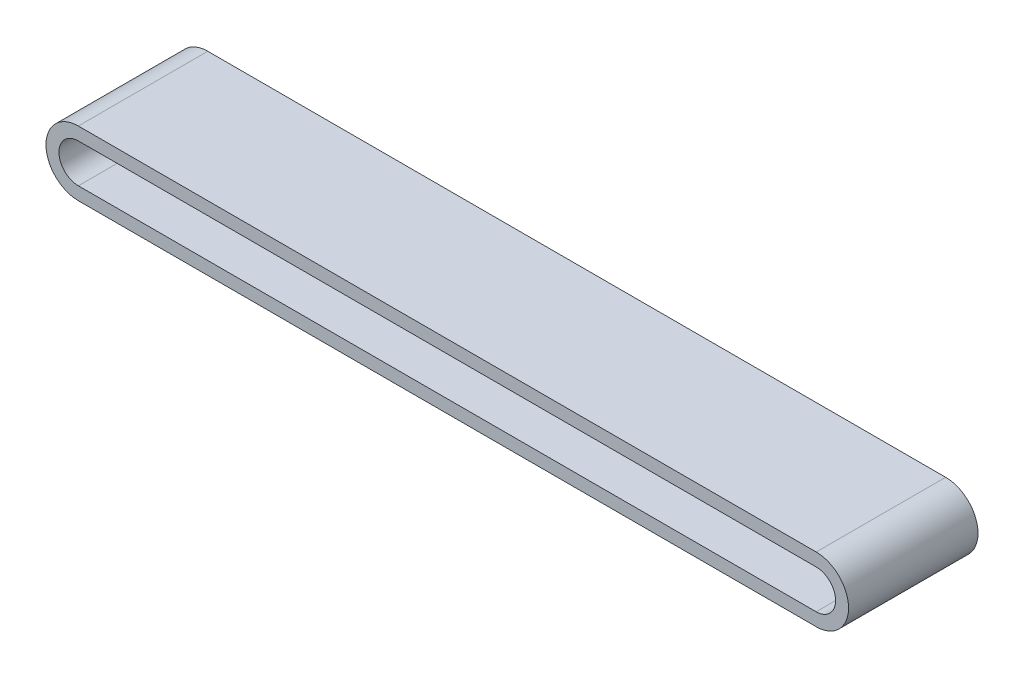
ISO-10303-21;
HEADER;
FILE_DESCRIPTION(('STEP AP214'),'2;1');
FILE_NAME('part.step','',(''),(''),'','','');
FILE_SCHEMA(('AUTOMOTIVE_DESIGN { 1 0 10303 214 1 1 1 1 }'));
ENDSEC;
DATA;
#1=APPLICATION_CONTEXT('core data for automotive mechanical design processes');
#2=APPLICATION_PROTOCOL_DEFINITION('international standard','automotive_design',2000,#1);
#3=PRODUCT_CONTEXT('',#1,'mechanical');
#4=PRODUCT('Part','Part','',(#3));
#5=PRODUCT_RELATED_PRODUCT_CATEGORY('part','',(#4));
#6=PRODUCT_DEFINITION_FORMATION('','',#4);
#7=PRODUCT_DEFINITION_CONTEXT('part definition',#1,'design');
#8=PRODUCT_DEFINITION('design','',#6,#7);
#9=PRODUCT_DEFINITION_SHAPE('','',#8);
#10=(LENGTH_UNIT() NAMED_UNIT(*) SI_UNIT(.MILLI.,.METRE.));
#11=(NAMED_UNIT(*) PLANE_ANGLE_UNIT() SI_UNIT($,.RADIAN.));
#12=(NAMED_UNIT(*) SI_UNIT($,.STERADIAN.) SOLID_ANGLE_UNIT());
#13=UNCERTAINTY_MEASURE_WITH_UNIT(LENGTH_MEASURE(1.E-05),#10,'distance_accuracy_value','');
#14=(GEOMETRIC_REPRESENTATION_CONTEXT(3) GLOBAL_UNCERTAINTY_ASSIGNED_CONTEXT((#13)) GLOBAL_UNIT_ASSIGNED_CONTEXT((#10,
#11,#12)) REPRESENTATION_CONTEXT('',''));
#15=CARTESIAN_POINT('',(0.,0.,0.));
#16=DIRECTION('',(0.,0.,1.));
#17=DIRECTION('',(1.,0.,0.));
#18=AXIS2_PLACEMENT_3D('',#15,#16,#17);
#19=CARTESIAN_POINT('',(-305.102040816327,0.,110.));
#20=DIRECTION('',(0.,0.,1.));
#21=DIRECTION('',(1.,0.,0.));
#22=AXIS2_PLACEMENT_3D('',#19,#20,#21);
#23=PLANE('',#22);
#24=CARTESIAN_POINT('',(-305.102040816327,0.,110.));
#25=DIRECTION('',(0.,0.,1.));
#26=DIRECTION('',(1.,0.,0.));
#27=AXIS2_PLACEMENT_3D('',#24,#25,#26);
#28=CIRCLE('',#27,25.);
#29=CARTESIAN_POINT('',(-305.102040816327,25.,110.));
#30=VERTEX_POINT('',#29);
#31=CARTESIAN_POINT('',(-305.102040816327,-25.,110.));
#32=VERTEX_POINT('',#31);
#33=EDGE_CURVE('E163',#30,#32,#28,.T.);
#34=ORIENTED_EDGE('',*,*,#33,.T.);
#35=DIRECTION('',(1.,0.,0.));
#36=VECTOR('',#35,1.);
#37=CARTESIAN_POINT('',(-305.102040816327,-25.,110.));
#38=LINE('',#37,#36);
#39=CARTESIAN_POINT('',(264.897959183673,-25.,110.));
#40=VERTEX_POINT('',#39);
#41=EDGE_CURVE('E166',#32,#40,#38,.T.);
#42=ORIENTED_EDGE('',*,*,#41,.T.);
#43=CARTESIAN_POINT('',(264.897959183673,0.,110.));
#44=DIRECTION('',(0.,0.,1.));
#45=DIRECTION('',(1.,0.,0.));
#46=AXIS2_PLACEMENT_3D('',#43,#44,#45);
#47=CIRCLE('',#46,25.);
#48=CARTESIAN_POINT('',(264.897959183673,25.,110.));
#49=VERTEX_POINT('',#48);
#50=EDGE_CURVE('E169',#40,#49,#47,.T.);
#51=ORIENTED_EDGE('',*,*,#50,.T.);
#52=DIRECTION('',(1.,0.,0.));
#53=VECTOR('',#52,1.);
#54=CARTESIAN_POINT('',(-305.102040816327,25.,110.));
#55=LINE('',#54,#53);
#56=EDGE_CURVE('E171',#30,#49,#55,.T.);
#57=ORIENTED_EDGE('',*,*,#56,.F.);
#58=EDGE_LOOP('',(#34,#42,#51,#57));
#59=FACE_BOUND('',#58,.T.);
#60=DIRECTION('',(1.,0.,0.));
#61=VECTOR('',#60,1.);
#62=CARTESIAN_POINT('',(-305.102040816327,-15.,110.));
#63=LINE('',#62,#61);
#64=CARTESIAN_POINT('',(-305.102040816327,-15.,110.));
#65=VERTEX_POINT('',#64);
#66=CARTESIAN_POINT('',(264.897959183673,-15.,110.));
#67=VERTEX_POINT('',#66);
#68=EDGE_CURVE('E136',#65,#67,#63,.T.);
#69=ORIENTED_EDGE('',*,*,#68,.F.);
#70=CARTESIAN_POINT('',(-305.102040816327,0.,110.));
#71=DIRECTION('',(0.,0.,1.));
#72=DIRECTION('',(1.,0.,0.));
#73=AXIS2_PLACEMENT_3D('',#70,#71,#72);
#74=CIRCLE('',#73,15.);
#75=CARTESIAN_POINT('',(-305.102040816327,15.,110.));
#76=VERTEX_POINT('',#75);
#77=EDGE_CURVE('E128',#76,#65,#74,.T.);
#78=ORIENTED_EDGE('',*,*,#77,.F.);
#79=DIRECTION('',(1.,0.,0.));
#80=VECTOR('',#79,1.);
#81=CARTESIAN_POINT('',(-305.102040816327,15.,110.));
#82=LINE('',#81,#80);
#83=CARTESIAN_POINT('',(264.897959183673,15.,110.));
#84=VERTEX_POINT('',#83);
#85=EDGE_CURVE('E150',#76,#84,#82,.T.);
#86=ORIENTED_EDGE('',*,*,#85,.T.);
#87=CARTESIAN_POINT('',(264.897959183673,0.,110.));
#88=DIRECTION('',(0.,0.,1.));
#89=DIRECTION('',(1.,0.,0.));
#90=AXIS2_PLACEMENT_3D('',#87,#88,#89);
#91=CIRCLE('',#90,15.);
#92=EDGE_CURVE('E148',#67,#84,#91,.T.);
#93=ORIENTED_EDGE('',*,*,#92,.F.);
#94=EDGE_LOOP('',(#69,#78,#86,#93));
#95=FACE_BOUND('',#94,.T.);
#96=ADVANCED_FACE('F63',(#59,#95),#23,.T.);
#97=CARTESIAN_POINT('',(-305.102040816327,0.,10.));
#98=DIRECTION('',(0.,0.,1.));
#99=DIRECTION('',(1.,0.,0.));
#100=AXIS2_PLACEMENT_3D('',#97,#98,#99);
#101=PLANE('',#100);
#102=CARTESIAN_POINT('',(-305.102040816327,0.,10.));
#103=DIRECTION('',(0.,0.,1.));
#104=DIRECTION('',(1.,0.,0.));
#105=AXIS2_PLACEMENT_3D('',#102,#103,#104);
#106=CIRCLE('',#105,25.);
#107=CARTESIAN_POINT('',(-305.102040816327,25.,10.));
#108=VERTEX_POINT('',#107);
#109=CARTESIAN_POINT('',(-305.102040816327,-25.,10.));
#110=VERTEX_POINT('',#109);
#111=EDGE_CURVE('E144',#108,#110,#106,.T.);
#112=ORIENTED_EDGE('',*,*,#111,.F.);
#113=DIRECTION('',(1.,0.,0.));
#114=VECTOR('',#113,1.);
#115=CARTESIAN_POINT('',(-305.102040816327,25.,10.));
#116=LINE('',#115,#114);
#117=CARTESIAN_POINT('',(264.897959183673,25.,10.));
#118=VERTEX_POINT('',#117);
#119=EDGE_CURVE('E167',#108,#118,#116,.T.);
#120=ORIENTED_EDGE('',*,*,#119,.T.);
#121=CARTESIAN_POINT('',(264.897959183673,0.,10.));
#122=DIRECTION('',(0.,0.,1.));
#123=DIRECTION('',(1.,0.,0.));
#124=AXIS2_PLACEMENT_3D('',#121,#122,#123);
#125=CIRCLE('',#124,25.);
#126=CARTESIAN_POINT('',(264.897959183673,-25.,10.));
#127=VERTEX_POINT('',#126);
#128=EDGE_CURVE('E179',#127,#118,#125,.T.);
#129=ORIENTED_EDGE('',*,*,#128,.F.);
#130=DIRECTION('',(1.,0.,0.));
#131=VECTOR('',#130,1.);
#132=CARTESIAN_POINT('',(-305.102040816327,-25.,10.));
#133=LINE('',#132,#131);
#134=EDGE_CURVE('E177',#110,#127,#133,.T.);
#135=ORIENTED_EDGE('',*,*,#134,.F.);
#136=EDGE_LOOP('',(#112,#120,#129,#135));
#137=FACE_BOUND('',#136,.T.);
#138=CARTESIAN_POINT('',(-305.102040816327,0.,10.));
#139=DIRECTION('',(0.,0.,1.));
#140=DIRECTION('',(1.,0.,0.));
#141=AXIS2_PLACEMENT_3D('',#138,#139,#140);
#142=CIRCLE('',#141,15.);
#143=CARTESIAN_POINT('',(-305.102040816327,15.,10.));
#144=VERTEX_POINT('',#143);
#145=CARTESIAN_POINT('',(-305.102040816327,-15.,10.));
#146=VERTEX_POINT('',#145);
#147=EDGE_CURVE('E86',#144,#146,#142,.T.);
#148=ORIENTED_EDGE('',*,*,#147,.T.);
#149=DIRECTION('',(1.,0.,0.));
#150=VECTOR('',#149,1.);
#151=CARTESIAN_POINT('',(-305.102040816327,-15.,10.));
#152=LINE('',#151,#150);
#153=CARTESIAN_POINT('',(264.897959183673,-15.,10.));
#154=VERTEX_POINT('',#153);
#155=EDGE_CURVE('E143',#146,#154,#152,.T.);
#156=ORIENTED_EDGE('',*,*,#155,.T.);
#157=CARTESIAN_POINT('',(264.897959183673,0.,10.));
#158=DIRECTION('',(0.,0.,1.));
#159=DIRECTION('',(1.,0.,0.));
#160=AXIS2_PLACEMENT_3D('',#157,#158,#159);
#161=CIRCLE('',#160,15.);
#162=CARTESIAN_POINT('',(264.897959183673,15.,10.));
#163=VERTEX_POINT('',#162);
#164=EDGE_CURVE('E156',#154,#163,#161,.T.);
#165=ORIENTED_EDGE('',*,*,#164,.T.);
#166=DIRECTION('',(1.,0.,0.));
#167=VECTOR('',#166,1.);
#168=CARTESIAN_POINT('',(-305.102040816327,15.,10.));
#169=LINE('',#168,#167);
#170=EDGE_CURVE('E137',#144,#163,#169,.T.);
#171=ORIENTED_EDGE('',*,*,#170,.F.);
#172=EDGE_LOOP('',(#148,#156,#165,#171));
#173=FACE_BOUND('',#172,.T.);
#174=ADVANCED_FACE('F196',(#137,#173),#101,.F.);
#175=CARTESIAN_POINT('',(-305.102040816327,0.,110.));
#176=DIRECTION('',(0.,0.,-1.));
#177=DIRECTION('',(-1.,0.,0.));
#178=AXIS2_PLACEMENT_3D('',#175,#176,#177);
#179=CYLINDRICAL_SURFACE('',#178,25.);
#180=ORIENTED_EDGE('',*,*,#111,.T.);
#181=DIRECTION('',(0.,0.,-1.));
#182=VECTOR('',#181,1.);
#183=CARTESIAN_POINT('',(-305.102040816327,-25.,110.));
#184=LINE('',#183,#182);
#185=EDGE_CURVE('E12',#32,#110,#184,.T.);
#186=ORIENTED_EDGE('',*,*,#185,.F.);
#187=ORIENTED_EDGE('',*,*,#33,.F.);
#188=DIRECTION('',(0.,0.,-1.));
#189=VECTOR('',#188,1.);
#190=CARTESIAN_POINT('',(-305.102040816327,25.,110.));
#191=LINE('',#190,#189);
#192=EDGE_CURVE('E174',#30,#108,#191,.T.);
#193=ORIENTED_EDGE('',*,*,#192,.T.);
#194=EDGE_LOOP('',(#180,#186,#187,#193));
#195=FACE_BOUND('',#194,.T.);
#196=ADVANCED_FACE('F65',(#195),#179,.T.);
#197=CARTESIAN_POINT('',(-305.102040816327,-25.,110.));
#198=DIRECTION('',(0.,1.,0.));
#199=DIRECTION('',(0.,0.,1.));
#200=AXIS2_PLACEMENT_3D('',#197,#198,#199);
#201=PLANE('',#200);
#202=ORIENTED_EDGE('',*,*,#134,.T.);
#203=DIRECTION('',(0.,0.,-1.));
#204=VECTOR('',#203,1.);
#205=CARTESIAN_POINT('',(264.897959183673,-25.,110.));
#206=LINE('',#205,#204);
#207=EDGE_CURVE('E71',#40,#127,#206,.T.);
#208=ORIENTED_EDGE('',*,*,#207,.F.);
#209=ORIENTED_EDGE('',*,*,#41,.F.);
#210=ORIENTED_EDGE('',*,*,#185,.T.);
#211=EDGE_LOOP('',(#202,#208,#209,#210));
#212=FACE_BOUND('',#211,.T.);
#213=ADVANCED_FACE('F205',(#212),#201,.F.);
#214=CARTESIAN_POINT('',(264.897959183673,0.,110.));
#215=DIRECTION('',(0.,0.,-1.));
#216=DIRECTION('',(-1.,0.,0.));
#217=AXIS2_PLACEMENT_3D('',#214,#215,#216);
#218=CYLINDRICAL_SURFACE('',#217,25.);
#219=ORIENTED_EDGE('',*,*,#128,.T.);
#220=DIRECTION('',(0.,0.,-1.));
#221=VECTOR('',#220,1.);
#222=CARTESIAN_POINT('',(264.897959183673,25.,110.));
#223=LINE('',#222,#221);
#224=EDGE_CURVE('E185',#49,#118,#223,.T.);
#225=ORIENTED_EDGE('',*,*,#224,.F.);
#226=ORIENTED_EDGE('',*,*,#50,.F.);
#227=ORIENTED_EDGE('',*,*,#207,.T.);
#228=EDGE_LOOP('',(#219,#225,#226,#227));
#229=FACE_BOUND('',#228,.T.);
#230=ADVANCED_FACE('F191',(#229),#218,.T.);
#231=CARTESIAN_POINT('',(-305.102040816327,25.,110.));
#232=DIRECTION('',(0.,1.,0.));
#233=DIRECTION('',(0.,0.,1.));
#234=AXIS2_PLACEMENT_3D('',#231,#232,#233);
#235=PLANE('',#234);
#236=ORIENTED_EDGE('',*,*,#119,.F.);
#237=ORIENTED_EDGE('',*,*,#192,.F.);
#238=ORIENTED_EDGE('',*,*,#56,.T.);
#239=ORIENTED_EDGE('',*,*,#224,.T.);
#240=EDGE_LOOP('',(#236,#237,#238,#239));
#241=FACE_BOUND('',#240,.T.);
#242=ADVANCED_FACE('F200',(#241),#235,.T.);
#243=CARTESIAN_POINT('',(-305.102040816327,0.,110.));
#244=DIRECTION('',(0.,0.,-1.));
#245=DIRECTION('',(-1.,0.,0.));
#246=AXIS2_PLACEMENT_3D('',#243,#244,#245);
#247=CYLINDRICAL_SURFACE('',#246,15.);
#248=ORIENTED_EDGE('',*,*,#147,.F.);
#249=DIRECTION('',(0.,0.,-1.));
#250=VECTOR('',#249,1.);
#251=CARTESIAN_POINT('',(-305.102040816327,15.,110.));
#252=LINE('',#251,#250);
#253=EDGE_CURVE('E132',#76,#144,#252,.T.);
#254=ORIENTED_EDGE('',*,*,#253,.F.);
#255=ORIENTED_EDGE('',*,*,#77,.T.);
#256=DIRECTION('',(0.,0.,-1.));
#257=VECTOR('',#256,1.);
#258=CARTESIAN_POINT('',(-305.102040816327,-15.,110.));
#259=LINE('',#258,#257);
#260=EDGE_CURVE('E131',#65,#146,#259,.T.);
#261=ORIENTED_EDGE('',*,*,#260,.T.);
#262=EDGE_LOOP('',(#248,#254,#255,#261));
#263=FACE_BOUND('',#262,.T.);
#264=ADVANCED_FACE('F130',(#263),#247,.F.);
#265=CARTESIAN_POINT('',(-305.102040816327,-15.,110.));
#266=DIRECTION('',(0.,1.,0.));
#267=DIRECTION('',(0.,0.,1.));
#268=AXIS2_PLACEMENT_3D('',#265,#266,#267);
#269=PLANE('',#268);
#270=ORIENTED_EDGE('',*,*,#155,.F.);
#271=ORIENTED_EDGE('',*,*,#260,.F.);
#272=ORIENTED_EDGE('',*,*,#68,.T.);
#273=DIRECTION('',(0.,0.,-1.));
#274=VECTOR('',#273,1.);
#275=CARTESIAN_POINT('',(264.897959183673,-15.,110.));
#276=LINE('',#275,#274);
#277=EDGE_CURVE('E145',#67,#154,#276,.T.);
#278=ORIENTED_EDGE('',*,*,#277,.T.);
#279=EDGE_LOOP('',(#270,#271,#272,#278));
#280=FACE_BOUND('',#279,.T.);
#281=ADVANCED_FACE('F140',(#280),#269,.T.);
#282=CARTESIAN_POINT('',(264.897959183673,0.,110.));
#283=DIRECTION('',(0.,0.,-1.));
#284=DIRECTION('',(-1.,0.,0.));
#285=AXIS2_PLACEMENT_3D('',#282,#283,#284);
#286=CYLINDRICAL_SURFACE('',#285,15.);
#287=ORIENTED_EDGE('',*,*,#164,.F.);
#288=ORIENTED_EDGE('',*,*,#277,.F.);
#289=ORIENTED_EDGE('',*,*,#92,.T.);
#290=DIRECTION('',(0.,0.,-1.));
#291=VECTOR('',#290,1.);
#292=CARTESIAN_POINT('',(264.897959183673,15.,110.));
#293=LINE('',#292,#291);
#294=EDGE_CURVE('E78',#84,#163,#293,.T.);
#295=ORIENTED_EDGE('',*,*,#294,.T.);
#296=EDGE_LOOP('',(#287,#288,#289,#295));
#297=FACE_BOUND('',#296,.T.);
#298=ADVANCED_FACE('F245',(#297),#286,.F.);
#299=CARTESIAN_POINT('',(-305.102040816327,15.,110.));
#300=DIRECTION('',(0.,1.,0.));
#301=DIRECTION('',(0.,0.,1.));
#302=AXIS2_PLACEMENT_3D('',#299,#300,#301);
#303=PLANE('',#302);
#304=ORIENTED_EDGE('',*,*,#170,.T.);
#305=ORIENTED_EDGE('',*,*,#294,.F.);
#306=ORIENTED_EDGE('',*,*,#85,.F.);
#307=ORIENTED_EDGE('',*,*,#253,.T.);
#308=EDGE_LOOP('',(#304,#305,#306,#307));
#309=FACE_BOUND('',#308,.T.);
#310=ADVANCED_FACE('F252',(#309),#303,.F.);
#311=CLOSED_SHELL('',(#96,#174,#196,#213,#230,#242,#264,#281,#298,#310));
#312=MANIFOLD_SOLID_BREP('B2',#311);
#313=ADVANCED_BREP_SHAPE_REPRESENTATION('',(#18,#312),#14);
#314=SHAPE_DEFINITION_REPRESENTATION(#9,#313);
ENDSEC;
END-ISO-10303-21;
